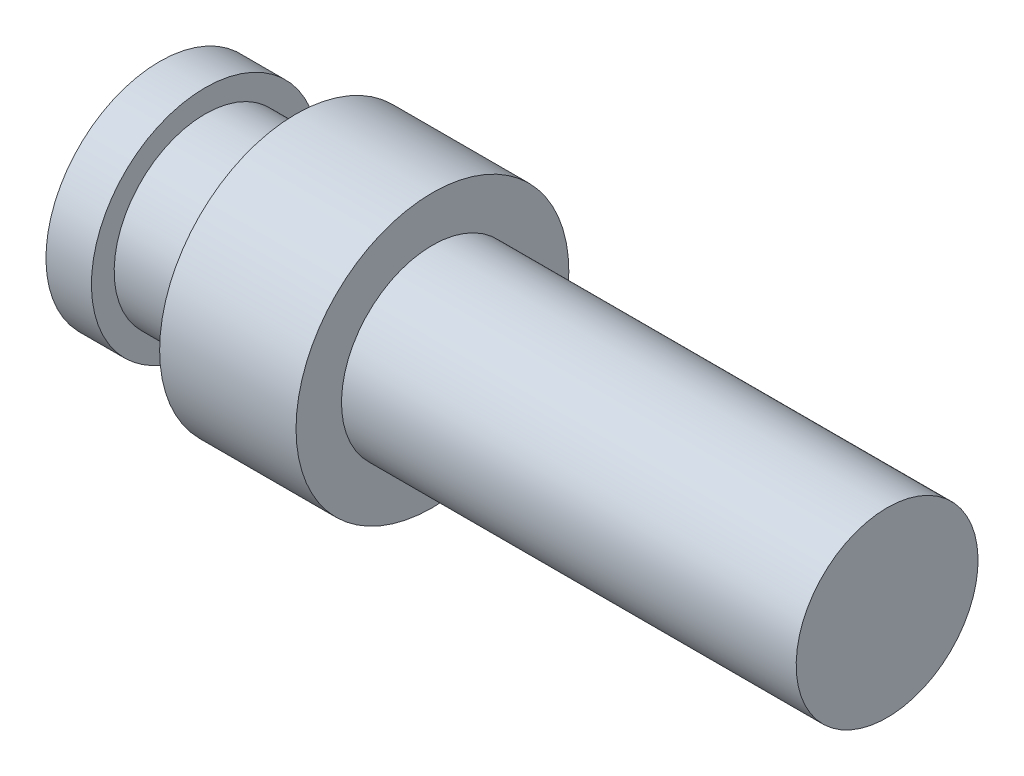
ISO-10303-21;
HEADER;
FILE_DESCRIPTION(('STEP AP214'),'2;1');
FILE_NAME('part.step','',(''),(''),'','','');
FILE_SCHEMA(('AUTOMOTIVE_DESIGN { 1 0 10303 214 1 1 1 1 }'));
ENDSEC;
DATA;
#1=APPLICATION_CONTEXT('core data for automotive mechanical design processes');
#2=APPLICATION_PROTOCOL_DEFINITION('international standard','automotive_design',2000,#1);
#3=PRODUCT_CONTEXT('',#1,'mechanical');
#4=PRODUCT('Part','Part','',(#3));
#5=PRODUCT_RELATED_PRODUCT_CATEGORY('part','',(#4));
#6=PRODUCT_DEFINITION_FORMATION('','',#4);
#7=PRODUCT_DEFINITION_CONTEXT('part definition',#1,'design');
#8=PRODUCT_DEFINITION('design','',#6,#7);
#9=PRODUCT_DEFINITION_SHAPE('','',#8);
#10=(LENGTH_UNIT() NAMED_UNIT(*) SI_UNIT(.MILLI.,.METRE.));
#11=(NAMED_UNIT(*) PLANE_ANGLE_UNIT() SI_UNIT($,.RADIAN.));
#12=(NAMED_UNIT(*) SI_UNIT($,.STERADIAN.) SOLID_ANGLE_UNIT());
#13=UNCERTAINTY_MEASURE_WITH_UNIT(LENGTH_MEASURE(1.E-05),#10,'distance_accuracy_value','');
#14=(GEOMETRIC_REPRESENTATION_CONTEXT(3) GLOBAL_UNCERTAINTY_ASSIGNED_CONTEXT((#13)) GLOBAL_UNIT_ASSIGNED_CONTEXT((#10,
#11,#12)) REPRESENTATION_CONTEXT('',''));
#15=CARTESIAN_POINT('',(0.,0.,0.));
#16=DIRECTION('',(0.,0.,1.));
#17=DIRECTION('',(1.,0.,0.));
#18=AXIS2_PLACEMENT_3D('',#15,#16,#17);
#19=CARTESIAN_POINT('',(0.,0.,0.));
#20=DIRECTION('',(-1.,0.,0.));
#21=DIRECTION('',(0.,-1.,0.));
#22=AXIS2_PLACEMENT_3D('',#19,#20,#21);
#23=PLANE('',#22);
#24=CARTESIAN_POINT('',(0.,0.,0.));
#25=DIRECTION('',(1.,0.,0.));
#26=DIRECTION('',(0.,1.,0.));
#27=AXIS2_PLACEMENT_3D('',#24,#25,#26);
#28=CIRCLE('',#27,2.5);
#29=CARTESIAN_POINT('',(0.,2.5,0.));
#30=VERTEX_POINT('',#29);
#31=EDGE_CURVE('E10',#30,#30,#28,.T.);
#32=ORIENTED_EDGE('',*,*,#31,.F.);
#33=EDGE_LOOP('',(#32));
#34=FACE_BOUND('',#33,.T.);
#35=ADVANCED_FACE('F32',(#34),#23,.T.);
#36=CARTESIAN_POINT('',(16.,0.,0.));
#37=DIRECTION('',(1.,0.,0.));
#38=DIRECTION('',(0.,1.,0.));
#39=AXIS2_PLACEMENT_3D('',#36,#37,#38);
#40=CYLINDRICAL_SURFACE('',#39,2.5);
#41=ORIENTED_EDGE('',*,*,#31,.T.);
#42=EDGE_LOOP('',(#41));
#43=FACE_BOUND('',#42,.T.);
#44=CARTESIAN_POINT('',(1.,0.,0.));
#45=DIRECTION('',(1.,0.,0.));
#46=DIRECTION('',(0.,1.,0.));
#47=AXIS2_PLACEMENT_3D('',#44,#45,#46);
#48=CIRCLE('',#47,2.5);
#49=CARTESIAN_POINT('',(1.,2.5,0.));
#50=VERTEX_POINT('',#49);
#51=EDGE_CURVE('E38',#50,#50,#48,.T.);
#52=ORIENTED_EDGE('',*,*,#51,.F.);
#53=EDGE_LOOP('',(#52));
#54=FACE_BOUND('',#53,.T.);
#55=ADVANCED_FACE('F80',(#43,#54),#40,.T.);
#56=CARTESIAN_POINT('',(1.,2.5,0.));
#57=DIRECTION('',(1.,0.,0.));
#58=DIRECTION('',(0.,1.,0.));
#59=AXIS2_PLACEMENT_3D('',#56,#57,#58);
#60=PLANE('',#59);
#61=ORIENTED_EDGE('',*,*,#51,.T.);
#62=EDGE_LOOP('',(#61));
#63=FACE_BOUND('',#62,.T.);
#64=CARTESIAN_POINT('',(1.,0.,0.));
#65=DIRECTION('',(1.,0.,0.));
#66=DIRECTION('',(0.,1.,0.));
#67=AXIS2_PLACEMENT_3D('',#64,#65,#66);
#68=CIRCLE('',#67,2.);
#69=CARTESIAN_POINT('',(1.,2.,0.));
#70=VERTEX_POINT('',#69);
#71=EDGE_CURVE('E42',#70,#70,#68,.T.);
#72=ORIENTED_EDGE('',*,*,#71,.F.);
#73=EDGE_LOOP('',(#72));
#74=FACE_BOUND('',#73,.T.);
#75=ADVANCED_FACE('F85',(#63,#74),#60,.T.);
#76=CARTESIAN_POINT('',(16.,0.,0.));
#77=DIRECTION('',(1.,0.,0.));
#78=DIRECTION('',(0.,1.,0.));
#79=AXIS2_PLACEMENT_3D('',#76,#77,#78);
#80=CYLINDRICAL_SURFACE('',#79,2.);
#81=ORIENTED_EDGE('',*,*,#71,.T.);
#82=EDGE_LOOP('',(#81));
#83=FACE_BOUND('',#82,.T.);
#84=CARTESIAN_POINT('',(3.,0.,0.));
#85=DIRECTION('',(1.,0.,0.));
#86=DIRECTION('',(0.,1.,0.));
#87=AXIS2_PLACEMENT_3D('',#84,#85,#86);
#88=CIRCLE('',#87,2.);
#89=CARTESIAN_POINT('',(3.,2.,0.));
#90=VERTEX_POINT('',#89);
#91=EDGE_CURVE('E46',#90,#90,#88,.T.);
#92=ORIENTED_EDGE('',*,*,#91,.F.);
#93=EDGE_LOOP('',(#92));
#94=FACE_BOUND('',#93,.T.);
#95=ADVANCED_FACE('F89',(#83,#94),#80,.T.);
#96=CARTESIAN_POINT('',(3.,2.,0.));
#97=DIRECTION('',(-1.,0.,0.));
#98=DIRECTION('',(0.,-1.,0.));
#99=AXIS2_PLACEMENT_3D('',#96,#97,#98);
#100=PLANE('',#99);
#101=ORIENTED_EDGE('',*,*,#91,.T.);
#102=EDGE_LOOP('',(#101));
#103=FACE_BOUND('',#102,.T.);
#104=CARTESIAN_POINT('',(3.,0.,0.));
#105=DIRECTION('',(1.,0.,0.));
#106=DIRECTION('',(0.,1.,0.));
#107=AXIS2_PLACEMENT_3D('',#104,#105,#106);
#108=CIRCLE('',#107,3.);
#109=CARTESIAN_POINT('',(3.,3.,0.));
#110=VERTEX_POINT('',#109);
#111=EDGE_CURVE('E51',#110,#110,#108,.T.);
#112=ORIENTED_EDGE('',*,*,#111,.F.);
#113=EDGE_LOOP('',(#112));
#114=FACE_BOUND('',#113,.T.);
#115=ADVANCED_FACE('F95',(#103,#114),#100,.T.);
#116=CARTESIAN_POINT('',(16.,0.,0.));
#117=DIRECTION('',(1.,0.,0.));
#118=DIRECTION('',(0.,1.,0.));
#119=AXIS2_PLACEMENT_3D('',#116,#117,#118);
#120=CYLINDRICAL_SURFACE('',#119,3.);
#121=ORIENTED_EDGE('',*,*,#111,.T.);
#122=EDGE_LOOP('',(#121));
#123=FACE_BOUND('',#122,.T.);
#124=CARTESIAN_POINT('',(6.,0.,0.));
#125=DIRECTION('',(1.,0.,0.));
#126=DIRECTION('',(0.,1.,0.));
#127=AXIS2_PLACEMENT_3D('',#124,#125,#126);
#128=CIRCLE('',#127,3.);
#129=CARTESIAN_POINT('',(6.,3.,0.));
#130=VERTEX_POINT('',#129);
#131=EDGE_CURVE('E54',#130,#130,#128,.T.);
#132=ORIENTED_EDGE('',*,*,#131,.F.);
#133=EDGE_LOOP('',(#132));
#134=FACE_BOUND('',#133,.T.);
#135=ADVANCED_FACE('F76',(#123,#134),#120,.T.);
#136=CARTESIAN_POINT('',(6.,3.,0.));
#137=DIRECTION('',(1.,0.,0.));
#138=DIRECTION('',(0.,1.,0.));
#139=AXIS2_PLACEMENT_3D('',#136,#137,#138);
#140=PLANE('',#139);
#141=ORIENTED_EDGE('',*,*,#131,.T.);
#142=EDGE_LOOP('',(#141));
#143=FACE_BOUND('',#142,.T.);
#144=CARTESIAN_POINT('',(6.,0.,0.));
#145=DIRECTION('',(1.,0.,0.));
#146=DIRECTION('',(0.,1.,0.));
#147=AXIS2_PLACEMENT_3D('',#144,#145,#146);
#148=CIRCLE('',#147,2.);
#149=CARTESIAN_POINT('',(6.,2.,0.));
#150=VERTEX_POINT('',#149);
#151=EDGE_CURVE('E57',#150,#150,#148,.T.);
#152=ORIENTED_EDGE('',*,*,#151,.F.);
#153=EDGE_LOOP('',(#152));
#154=FACE_BOUND('',#153,.T.);
#155=ADVANCED_FACE('F68',(#143,#154),#140,.T.);
#156=CARTESIAN_POINT('',(16.,0.,0.));
#157=DIRECTION('',(1.,0.,0.));
#158=DIRECTION('',(0.,1.,0.));
#159=AXIS2_PLACEMENT_3D('',#156,#157,#158);
#160=CYLINDRICAL_SURFACE('',#159,2.);
#161=ORIENTED_EDGE('',*,*,#151,.T.);
#162=EDGE_LOOP('',(#161));
#163=FACE_BOUND('',#162,.T.);
#164=CARTESIAN_POINT('',(16.,0.,0.));
#165=DIRECTION('',(1.,0.,0.));
#166=DIRECTION('',(0.,1.,0.));
#167=AXIS2_PLACEMENT_3D('',#164,#165,#166);
#168=CIRCLE('',#167,2.);
#169=CARTESIAN_POINT('',(16.,2.,0.));
#170=VERTEX_POINT('',#169);
#171=EDGE_CURVE('E60',#170,#170,#168,.T.);
#172=ORIENTED_EDGE('',*,*,#171,.F.);
#173=EDGE_LOOP('',(#172));
#174=FACE_BOUND('',#173,.T.);
#175=ADVANCED_FACE('F66',(#163,#174),#160,.T.);
#176=CARTESIAN_POINT('',(16.,2.,0.));
#177=DIRECTION('',(1.,0.,0.));
#178=DIRECTION('',(0.,1.,0.));
#179=AXIS2_PLACEMENT_3D('',#176,#177,#178);
#180=PLANE('',#179);
#181=ORIENTED_EDGE('',*,*,#171,.T.);
#182=EDGE_LOOP('',(#181));
#183=FACE_BOUND('',#182,.T.);
#184=ADVANCED_FACE('F64',(#183),#180,.T.);
#185=CLOSED_SHELL('',(#35,#55,#75,#95,#115,#135,#155,#175,#184));
#186=MANIFOLD_SOLID_BREP('B2',#185);
#187=ADVANCED_BREP_SHAPE_REPRESENTATION('',(#18,#186),#14);
#188=SHAPE_DEFINITION_REPRESENTATION(#9,#187);
ENDSEC;
END-ISO-10303-21;
